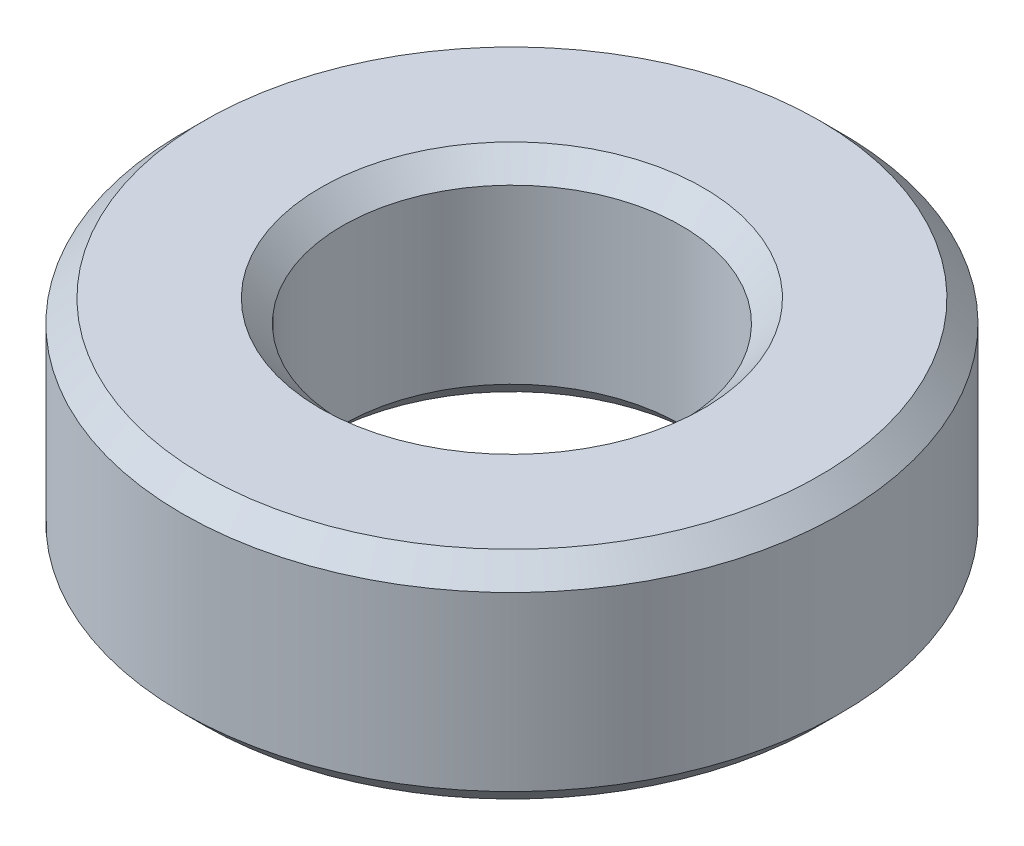
ISO-10303-21;
HEADER;
FILE_DESCRIPTION(('STEP AP214'),'2;1');
FILE_NAME('part.step','',(''),(''),'','','');
FILE_SCHEMA(('AUTOMOTIVE_DESIGN { 1 0 10303 214 1 1 1 1 }'));
ENDSEC;
DATA;
#1=APPLICATION_CONTEXT('core data for automotive mechanical design processes');
#2=APPLICATION_PROTOCOL_DEFINITION('international standard','automotive_design',2000,#1);
#3=PRODUCT_CONTEXT('',#1,'mechanical');
#4=PRODUCT('Part','Part','',(#3));
#5=PRODUCT_RELATED_PRODUCT_CATEGORY('part','',(#4));
#6=PRODUCT_DEFINITION_FORMATION('','',#4);
#7=PRODUCT_DEFINITION_CONTEXT('part definition',#1,'design');
#8=PRODUCT_DEFINITION('design','',#6,#7);
#9=PRODUCT_DEFINITION_SHAPE('','',#8);
#10=(LENGTH_UNIT() NAMED_UNIT(*) SI_UNIT(.MILLI.,.METRE.));
#11=(NAMED_UNIT(*) PLANE_ANGLE_UNIT() SI_UNIT($,.RADIAN.));
#12=(NAMED_UNIT(*) SI_UNIT($,.STERADIAN.) SOLID_ANGLE_UNIT());
#13=UNCERTAINTY_MEASURE_WITH_UNIT(LENGTH_MEASURE(1.E-05),#10,'distance_accuracy_value','');
#14=(GEOMETRIC_REPRESENTATION_CONTEXT(3) GLOBAL_UNCERTAINTY_ASSIGNED_CONTEXT((#13)) GLOBAL_UNIT_ASSIGNED_CONTEXT((#10,
#11,#12)) REPRESENTATION_CONTEXT('',''));
#15=CARTESIAN_POINT('',(0.,0.,0.));
#16=DIRECTION('',(0.,0.,1.));
#17=DIRECTION('',(1.,0.,0.));
#18=AXIS2_PLACEMENT_3D('',#15,#16,#17);
#19=CARTESIAN_POINT('',(0.,27.8936178407838,0.));
#20=DIRECTION('',(0.,-1.,0.));
#21=DIRECTION('',(0.,0.,-1.));
#22=AXIS2_PLACEMENT_3D('',#19,#20,#21);
#23=CYLINDRICAL_SURFACE('',#22,42.5);
#24=CARTESIAN_POINT('',(0.,2.83158793078945,0.));
#25=DIRECTION('',(0.,1.,0.));
#26=DIRECTION('',(0.,0.,1.));
#27=AXIS2_PLACEMENT_3D('',#24,#25,#26);
#28=CIRCLE('',#27,42.5);
#29=CARTESIAN_POINT('',(0.,2.83158793078945,42.5));
#30=VERTEX_POINT('',#29);
#31=EDGE_CURVE('E10',#30,#30,#28,.T.);
#32=ORIENTED_EDGE('',*,*,#31,.T.);
#33=EDGE_LOOP('',(#32));
#34=FACE_BOUND('',#33,.T.);
#35=CARTESIAN_POINT('',(0.,25.0620299099943,0.));
#36=DIRECTION('',(0.,1.,0.));
#37=DIRECTION('',(0.,0.,1.));
#38=AXIS2_PLACEMENT_3D('',#35,#36,#37);
#39=CIRCLE('',#38,42.5);
#40=CARTESIAN_POINT('',(0.,25.0620299099943,42.5));
#41=VERTEX_POINT('',#40);
#42=EDGE_CURVE('E50',#41,#41,#39,.F.);
#43=ORIENTED_EDGE('',*,*,#42,.T.);
#44=EDGE_LOOP('',(#43));
#45=FACE_BOUND('',#44,.T.);
#46=ADVANCED_FACE('F39',(#34,#45),#23,.T.);
#47=CARTESIAN_POINT('',(0.,27.8936178407838,0.));
#48=DIRECTION('',(0.,1.,0.));
#49=DIRECTION('',(0.,0.,1.));
#50=AXIS2_PLACEMENT_3D('',#47,#48,#49);
#51=PLANE('',#50);
#52=CARTESIAN_POINT('',(0.,27.8936178407838,0.));
#53=DIRECTION('',(0.,1.,0.));
#54=DIRECTION('',(0.,0.,1.));
#55=AXIS2_PLACEMENT_3D('',#52,#53,#54);
#56=CIRCLE('',#55,24.6766405736705);
#57=CARTESIAN_POINT('',(0.,27.8936178407838,24.6766405736705));
#58=VERTEX_POINT('',#57);
#59=EDGE_CURVE('E58',#58,#58,#56,.F.);
#60=ORIENTED_EDGE('',*,*,#59,.T.);
#61=EDGE_LOOP('',(#60));
#62=FACE_BOUND('',#61,.T.);
#63=CARTESIAN_POINT('',(0.,27.8936178407838,0.));
#64=DIRECTION('',(0.,1.,0.));
#65=DIRECTION('',(0.,0.,1.));
#66=AXIS2_PLACEMENT_3D('',#63,#64,#65);
#67=CIRCLE('',#66,39.6684120692106);
#68=CARTESIAN_POINT('',(0.,27.8936178407838,39.6684120692106));
#69=VERTEX_POINT('',#68);
#70=EDGE_CURVE('E61',#69,#69,#67,.T.);
#71=ORIENTED_EDGE('',*,*,#70,.T.);
#72=EDGE_LOOP('',(#71));
#73=FACE_BOUND('',#72,.T.);
#74=ADVANCED_FACE('F88',(#62,#73),#51,.T.);
#75=CARTESIAN_POINT('',(0.,0.,0.));
#76=DIRECTION('',(0.,1.,0.));
#77=DIRECTION('',(0.,0.,1.));
#78=AXIS2_PLACEMENT_3D('',#75,#76,#77);
#79=PLANE('',#78);
#80=CARTESIAN_POINT('',(0.,0.,0.));
#81=DIRECTION('',(0.,1.,0.));
#82=DIRECTION('',(0.,0.,1.));
#83=AXIS2_PLACEMENT_3D('',#80,#81,#82);
#84=CIRCLE('',#83,24.6766405736705);
#85=CARTESIAN_POINT('',(0.,0.,24.6766405736705));
#86=VERTEX_POINT('',#85);
#87=EDGE_CURVE('E51',#86,#86,#84,.T.);
#88=ORIENTED_EDGE('',*,*,#87,.T.);
#89=EDGE_LOOP('',(#88));
#90=FACE_BOUND('',#89,.T.);
#91=CARTESIAN_POINT('',(0.,0.,0.));
#92=DIRECTION('',(0.,1.,0.));
#93=DIRECTION('',(0.,0.,1.));
#94=AXIS2_PLACEMENT_3D('',#91,#92,#93);
#95=CIRCLE('',#94,39.6684120692105);
#96=CARTESIAN_POINT('',(0.,0.,39.6684120692105));
#97=VERTEX_POINT('',#96);
#98=EDGE_CURVE('E54',#97,#97,#95,.F.);
#99=ORIENTED_EDGE('',*,*,#98,.T.);
#100=EDGE_LOOP('',(#99));
#101=FACE_BOUND('',#100,.T.);
#102=ADVANCED_FACE('F83',(#90,#101),#79,.F.);
#103=CARTESIAN_POINT('',(0.,27.8936178407838,0.));
#104=DIRECTION('',(0.,-1.,0.));
#105=DIRECTION('',(0.,0.,-1.));
#106=AXIS2_PLACEMENT_3D('',#103,#104,#105);
#107=CYLINDRICAL_SURFACE('',#106,21.845052642881);
#108=CARTESIAN_POINT('',(0.,25.0620299099943,0.));
#109=DIRECTION('',(0.,1.,0.));
#110=DIRECTION('',(0.,0.,1.));
#111=AXIS2_PLACEMENT_3D('',#108,#109,#110);
#112=CIRCLE('',#111,21.845052642881);
#113=CARTESIAN_POINT('',(0.,25.0620299099943,21.845052642881));
#114=VERTEX_POINT('',#113);
#115=EDGE_CURVE('E67',#114,#114,#112,.T.);
#116=ORIENTED_EDGE('',*,*,#115,.T.);
#117=EDGE_LOOP('',(#116));
#118=FACE_BOUND('',#117,.T.);
#119=CARTESIAN_POINT('',(0.,2.83158793078945,0.));
#120=DIRECTION('',(0.,1.,0.));
#121=DIRECTION('',(0.,0.,1.));
#122=AXIS2_PLACEMENT_3D('',#119,#120,#121);
#123=CIRCLE('',#122,21.845052642881);
#124=CARTESIAN_POINT('',(0.,2.83158793078945,21.845052642881));
#125=VERTEX_POINT('',#124);
#126=EDGE_CURVE('E69',#125,#125,#123,.F.);
#127=ORIENTED_EDGE('',*,*,#126,.T.);
#128=EDGE_LOOP('',(#127));
#129=FACE_BOUND('',#128,.T.);
#130=ADVANCED_FACE('F71',(#118,#129),#107,.F.);
#131=CARTESIAN_POINT('',(0.,25.0620299099943,0.));
#132=DIRECTION('',(0.,1.,0.));
#133=DIRECTION('',(0.,0.,1.));
#134=AXIS2_PLACEMENT_3D('',#131,#132,#133);
#135=CONICAL_SURFACE('',#134,21.845052642881,0.785398163397452);
#136=ORIENTED_EDGE('',*,*,#59,.F.);
#137=EDGE_LOOP('',(#136));
#138=FACE_BOUND('',#137,.T.);
#139=ORIENTED_EDGE('',*,*,#115,.F.);
#140=EDGE_LOOP('',(#139));
#141=FACE_BOUND('',#140,.T.);
#142=ADVANCED_FACE('F77',(#138,#141),#135,.F.);
#143=CARTESIAN_POINT('',(0.,0.,0.));
#144=DIRECTION('',(0.,-1.,0.));
#145=DIRECTION('',(0.,0.,-1.));
#146=AXIS2_PLACEMENT_3D('',#143,#144,#145);
#147=CONICAL_SURFACE('',#146,24.6766405736705,0.785398163397447);
#148=ORIENTED_EDGE('',*,*,#126,.F.);
#149=EDGE_LOOP('',(#148));
#150=FACE_BOUND('',#149,.T.);
#151=ORIENTED_EDGE('',*,*,#87,.F.);
#152=EDGE_LOOP('',(#151));
#153=FACE_BOUND('',#152,.T.);
#154=ADVANCED_FACE('F73',(#150,#153),#147,.F.);
#155=CARTESIAN_POINT('',(0.,2.83158793078945,0.));
#156=DIRECTION('',(0.,1.,0.));
#157=DIRECTION('',(0.,0.,1.));
#158=AXIS2_PLACEMENT_3D('',#155,#156,#157);
#159=CONICAL_SURFACE('',#158,42.5,0.785398163397452);
#160=ORIENTED_EDGE('',*,*,#98,.F.);
#161=EDGE_LOOP('',(#160));
#162=FACE_BOUND('',#161,.T.);
#163=ORIENTED_EDGE('',*,*,#31,.F.);
#164=EDGE_LOOP('',(#163));
#165=FACE_BOUND('',#164,.T.);
#166=ADVANCED_FACE('F76',(#162,#165),#159,.T.);
#167=CARTESIAN_POINT('',(0.,27.8936178407838,0.));
#168=DIRECTION('',(0.,-1.,0.));
#169=DIRECTION('',(0.,0.,-1.));
#170=AXIS2_PLACEMENT_3D('',#167,#168,#169);
#171=CONICAL_SURFACE('',#170,39.6684120692106,0.785398163397443);
#172=ORIENTED_EDGE('',*,*,#42,.F.);
#173=EDGE_LOOP('',(#172));
#174=FACE_BOUND('',#173,.T.);
#175=ORIENTED_EDGE('',*,*,#70,.F.);
#176=EDGE_LOOP('',(#175));
#177=FACE_BOUND('',#176,.T.);
#178=ADVANCED_FACE('F45',(#174,#177),#171,.T.);
#179=CLOSED_SHELL('',(#46,#74,#102,#130,#142,#154,#166,#178));
#180=MANIFOLD_SOLID_BREP('B2',#179);
#181=ADVANCED_BREP_SHAPE_REPRESENTATION('',(#18,#180),#14);
#182=SHAPE_DEFINITION_REPRESENTATION(#9,#181);
ENDSEC;
END-ISO-10303-21;
